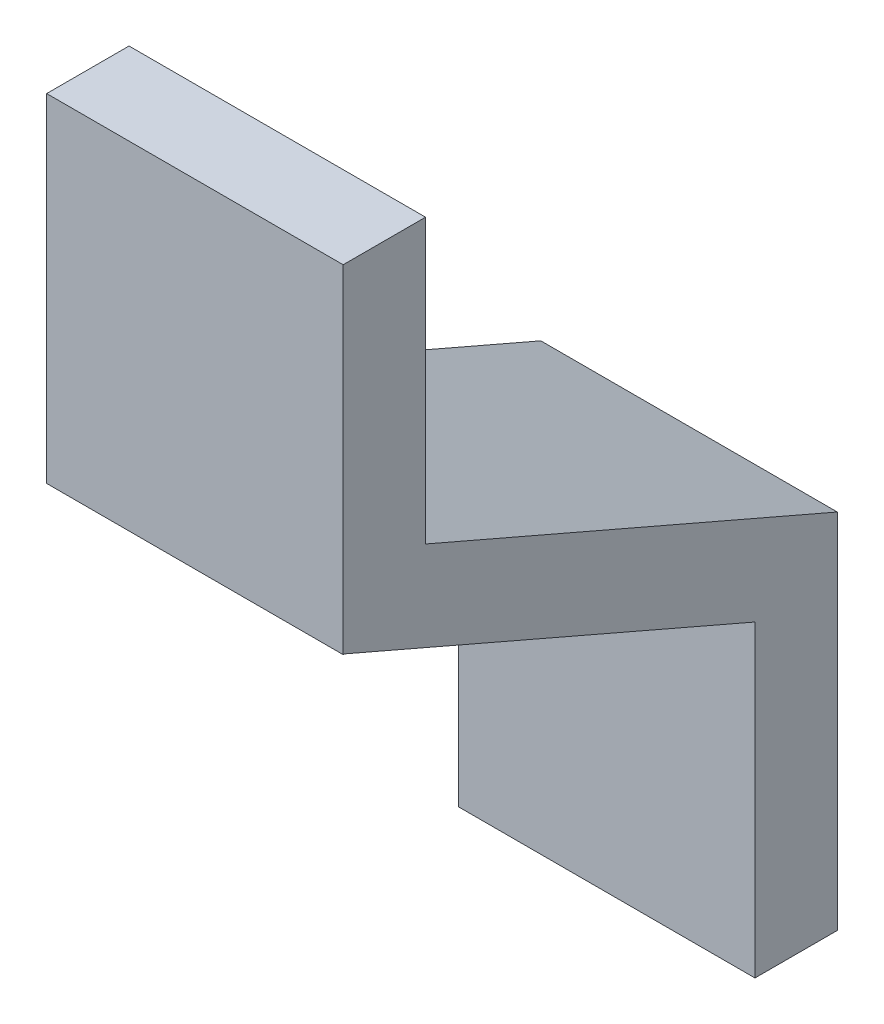
ISO-10303-21;
HEADER;
FILE_DESCRIPTION(('STEP AP214'),'2;1');
FILE_NAME('part.step','',(''),(''),'','','');
FILE_SCHEMA(('AUTOMOTIVE_DESIGN { 1 0 10303 214 1 1 1 1 }'));
ENDSEC;
DATA;
#1=APPLICATION_CONTEXT('core data for automotive mechanical design processes');
#2=APPLICATION_PROTOCOL_DEFINITION('international standard','automotive_design',2000,#1);
#3=PRODUCT_CONTEXT('',#1,'mechanical');
#4=PRODUCT('Part','Part','',(#3));
#5=PRODUCT_RELATED_PRODUCT_CATEGORY('part','',(#4));
#6=PRODUCT_DEFINITION_FORMATION('','',#4);
#7=PRODUCT_DEFINITION_CONTEXT('part definition',#1,'design');
#8=PRODUCT_DEFINITION('design','',#6,#7);
#9=PRODUCT_DEFINITION_SHAPE('','',#8);
#10=(LENGTH_UNIT() NAMED_UNIT(*) SI_UNIT(.MILLI.,.METRE.));
#11=(NAMED_UNIT(*) PLANE_ANGLE_UNIT() SI_UNIT($,.RADIAN.));
#12=(NAMED_UNIT(*) SI_UNIT($,.STERADIAN.) SOLID_ANGLE_UNIT());
#13=UNCERTAINTY_MEASURE_WITH_UNIT(LENGTH_MEASURE(1.E-05),#10,'distance_accuracy_value','');
#14=(GEOMETRIC_REPRESENTATION_CONTEXT(3) GLOBAL_UNCERTAINTY_ASSIGNED_CONTEXT((#13)) GLOBAL_UNIT_ASSIGNED_CONTEXT((#10,
#11,#12)) REPRESENTATION_CONTEXT('',''));
#15=CARTESIAN_POINT('',(0.,0.,0.));
#16=DIRECTION('',(0.,0.,1.));
#17=DIRECTION('',(1.,0.,0.));
#18=AXIS2_PLACEMENT_3D('',#15,#16,#17);
#19=CARTESIAN_POINT('',(8.22,0.999999996424,0.5));
#20=DIRECTION('',(0.,1.,0.));
#21=DIRECTION('',(0.,0.,1.));
#22=AXIS2_PLACEMENT_3D('',#19,#20,#21);
#23=PLANE('',#22);
#24=DIRECTION('',(1.,0.,0.));
#25=VECTOR('',#24,1.);
#26=CARTESIAN_POINT('',(8.22,0.999999996424,0.5));
#27=LINE('',#26,#25);
#28=CARTESIAN_POINT('',(8.580000014305,0.999999996424,0.5));
#29=VERTEX_POINT('',#28);
#30=CARTESIAN_POINT('',(8.22,0.999999996424,0.5));
#31=VERTEX_POINT('',#30);
#32=EDGE_CURVE('E140',#29,#31,#27,.F.);
#33=ORIENTED_EDGE('',*,*,#32,.T.);
#34=DIRECTION('',(0.,0.,-1.));
#35=VECTOR('',#34,1.);
#36=CARTESIAN_POINT('',(8.22,0.999999996424,0.));
#37=LINE('',#36,#35);
#38=CARTESIAN_POINT('',(8.22,0.999999996424,0.60000000149));
#39=VERTEX_POINT('',#38);
#40=EDGE_CURVE('E133',#31,#39,#37,.F.);
#41=ORIENTED_EDGE('',*,*,#40,.T.);
#42=DIRECTION('',(1.,0.,0.));
#43=VECTOR('',#42,1.);
#44=CARTESIAN_POINT('',(8.22,0.999999996424,0.60000000149));
#45=LINE('',#44,#43);
#46=CARTESIAN_POINT('',(8.580000014305,0.999999996424,0.60000000149));
#47=VERTEX_POINT('',#46);
#48=EDGE_CURVE('E129',#47,#39,#45,.F.);
#49=ORIENTED_EDGE('',*,*,#48,.F.);
#50=DIRECTION('',(0.,0.,-1.));
#51=VECTOR('',#50,1.);
#52=CARTESIAN_POINT('',(8.580000014305,0.999999996424,0.));
#53=LINE('',#52,#51);
#54=EDGE_CURVE('E106',#29,#47,#53,.F.);
#55=ORIENTED_EDGE('',*,*,#54,.F.);
#56=EDGE_LOOP('',(#33,#41,#49,#55));
#57=FACE_BOUND('',#56,.T.);
#58=ADVANCED_FACE('F17',(#57),#23,.T.);
#59=CARTESIAN_POINT('',(8.22,0.59,0.60000000149));
#60=DIRECTION('',(0.,0.,1.));
#61=DIRECTION('',(1.,0.,0.));
#62=AXIS2_PLACEMENT_3D('',#59,#60,#61);
#63=PLANE('',#62);
#64=DIRECTION('',(0.,1.,0.));
#65=VECTOR('',#64,1.);
#66=CARTESIAN_POINT('',(8.22,0.44,0.60000000149));
#67=LINE('',#66,#65);
#68=CARTESIAN_POINT('',(8.22,0.59,0.60000000149));
#69=VERTEX_POINT('',#68);
#70=EDGE_CURVE('E136',#39,#69,#67,.F.);
#71=ORIENTED_EDGE('',*,*,#70,.T.);
#72=DIRECTION('',(1.,0.,0.));
#73=VECTOR('',#72,1.);
#74=CARTESIAN_POINT('',(8.22,0.59,0.60000000149));
#75=LINE('',#74,#73);
#76=CARTESIAN_POINT('',(8.580000014305,0.59,0.60000000149));
#77=VERTEX_POINT('',#76);
#78=EDGE_CURVE('E92',#69,#77,#75,.T.);
#79=ORIENTED_EDGE('',*,*,#78,.T.);
#80=DIRECTION('',(0.,1.,0.));
#81=VECTOR('',#80,1.);
#82=CARTESIAN_POINT('',(8.580000014305,0.44,0.60000000149));
#83=LINE('',#82,#81);
#84=EDGE_CURVE('E73',#47,#77,#83,.F.);
#85=ORIENTED_EDGE('',*,*,#84,.F.);
#86=ORIENTED_EDGE('',*,*,#48,.T.);
#87=EDGE_LOOP('',(#71,#79,#85,#86));
#88=FACE_BOUND('',#87,.T.);
#89=ADVANCED_FACE('F285',(#88),#63,.T.);
#90=CARTESIAN_POINT('',(8.22,0.59,0.5));
#91=DIRECTION('',(0.,1.,0.));
#92=DIRECTION('',(0.,0.,1.));
#93=AXIS2_PLACEMENT_3D('',#90,#91,#92);
#94=PLANE('',#93);
#95=DIRECTION('',(1.,0.,0.));
#96=VECTOR('',#95,1.);
#97=CARTESIAN_POINT('',(8.22,0.590000000000416,0.59842599626982));
#98=LINE('',#97,#96);
#99=CARTESIAN_POINT('',(8.580000014305,0.590000000000104,0.598425996269911));
#100=VERTEX_POINT('',#99);
#101=CARTESIAN_POINT('',(8.22,0.590000000000104,0.59842599626991));
#102=VERTEX_POINT('',#101);
#103=EDGE_CURVE('E84',#100,#102,#98,.F.);
#104=ORIENTED_EDGE('',*,*,#103,.F.);
#105=DIRECTION('',(0.,0.,-1.));
#106=VECTOR('',#105,1.);
#107=CARTESIAN_POINT('',(8.580000014305,0.59,0.));
#108=LINE('',#107,#106);
#109=EDGE_CURVE('E20',#77,#100,#108,.T.);
#110=ORIENTED_EDGE('',*,*,#109,.F.);
#111=ORIENTED_EDGE('',*,*,#78,.F.);
#112=DIRECTION('',(0.,0.,1.));
#113=VECTOR('',#112,1.);
#114=CARTESIAN_POINT('',(8.22,0.59,0.5));
#115=LINE('',#114,#113);
#116=EDGE_CURVE('E87',#69,#102,#115,.F.);
#117=ORIENTED_EDGE('',*,*,#116,.T.);
#118=EDGE_LOOP('',(#104,#110,#111,#117));
#119=FACE_BOUND('',#118,.T.);
#120=ADVANCED_FACE('F85',(#119),#94,.F.);
#121=CARTESIAN_POINT('',(8.22,0.348224508223,0.03971472531736));
#122=DIRECTION('',(0.,-0.917754904098641,0.397147247255844));
#123=DIRECTION('',(0.,-0.397147247255844,-0.917754904098641));
#124=AXIS2_PLACEMENT_3D('',#121,#122,#123);
#125=PLANE('',#124);
#126=DIRECTION('',(0.,-0.397147247255413,-0.917754904098827));
#127=VECTOR('',#126,1.);
#128=CARTESIAN_POINT('',(8.580000014305,0.59,0.59842599627));
#129=LINE('',#128,#127);
#130=CARTESIAN_POINT('',(8.580000014305,0.37431222660502,0.10000000149));
#131=VERTEX_POINT('',#130);
#132=EDGE_CURVE('E80',#100,#131,#129,.T.);
#133=ORIENTED_EDGE('',*,*,#132,.F.);
#134=ORIENTED_EDGE('',*,*,#103,.T.);
#135=DIRECTION('',(0.,-0.397147247255413,-0.917754904098827));
#136=VECTOR('',#135,1.);
#137=CARTESIAN_POINT('',(8.22,0.59,0.59842599627));
#138=LINE('',#137,#136);
#139=CARTESIAN_POINT('',(8.22,0.374312226605,0.10000000149));
#140=VERTEX_POINT('',#139);
#141=EDGE_CURVE('E122',#102,#140,#138,.T.);
#142=ORIENTED_EDGE('',*,*,#141,.T.);
#143=DIRECTION('',(1.,0.,0.));
#144=VECTOR('',#143,1.);
#145=CARTESIAN_POINT('',(8.22,0.374312226605,0.10000000149));
#146=LINE('',#145,#144);
#147=EDGE_CURVE('E91',#131,#140,#146,.F.);
#148=ORIENTED_EDGE('',*,*,#147,.F.);
#149=EDGE_LOOP('',(#133,#134,#142,#148));
#150=FACE_BOUND('',#149,.T.);
#151=ADVANCED_FACE('F94',(#150),#125,.T.);
#152=CARTESIAN_POINT('',(8.22,0.,0.10000000149));
#153=DIRECTION('',(0.,0.,1.));
#154=DIRECTION('',(1.,0.,0.));
#155=AXIS2_PLACEMENT_3D('',#152,#153,#154);
#156=PLANE('',#155);
#157=ORIENTED_EDGE('',*,*,#147,.T.);
#158=DIRECTION('',(0.,1.,0.));
#159=VECTOR('',#158,1.);
#160=CARTESIAN_POINT('',(8.22,0.44,0.10000000149));
#161=LINE('',#160,#159);
#162=CARTESIAN_POINT('',(8.22,0.,0.10000000149));
#163=VERTEX_POINT('',#162);
#164=EDGE_CURVE('E118',#140,#163,#161,.F.);
#165=ORIENTED_EDGE('',*,*,#164,.T.);
#166=DIRECTION('',(1.,0.,0.));
#167=VECTOR('',#166,1.);
#168=CARTESIAN_POINT('',(8.22,0.,0.10000000149));
#169=LINE('',#168,#167);
#170=CARTESIAN_POINT('',(8.580000014305,0.,0.10000000149));
#171=VERTEX_POINT('',#170);
#172=EDGE_CURVE('E115',#163,#171,#169,.T.);
#173=ORIENTED_EDGE('',*,*,#172,.T.);
#174=DIRECTION('',(0.,1.,0.));
#175=VECTOR('',#174,1.);
#176=CARTESIAN_POINT('',(8.580000014305,0.44,0.10000000149));
#177=LINE('',#176,#175);
#178=EDGE_CURVE('E96',#131,#171,#177,.F.);
#179=ORIENTED_EDGE('',*,*,#178,.F.);
#180=EDGE_LOOP('',(#157,#165,#173,#179));
#181=FACE_BOUND('',#180,.T.);
#182=ADVANCED_FACE('F202',(#181),#156,.T.);
#183=CARTESIAN_POINT('',(8.22,0.,0.));
#184=DIRECTION('',(0.,1.,0.));
#185=DIRECTION('',(0.,0.,1.));
#186=AXIS2_PLACEMENT_3D('',#183,#184,#185);
#187=PLANE('',#186);
#188=DIRECTION('',(0.,0.,-1.));
#189=VECTOR('',#188,1.);
#190=CARTESIAN_POINT('',(8.22,0.,0.));
#191=LINE('',#190,#189);
#192=CARTESIAN_POINT('',(8.22,0.,0.));
#193=VERTEX_POINT('',#192);
#194=EDGE_CURVE('E121',#163,#193,#191,.T.);
#195=ORIENTED_EDGE('',*,*,#194,.T.);
#196=DIRECTION('',(1.,0.,0.));
#197=VECTOR('',#196,1.);
#198=CARTESIAN_POINT('',(8.22,0.,0.));
#199=LINE('',#198,#197);
#200=CARTESIAN_POINT('',(8.580000014305,0.,0.));
#201=VERTEX_POINT('',#200);
#202=EDGE_CURVE('E112',#193,#201,#199,.T.);
#203=ORIENTED_EDGE('',*,*,#202,.T.);
#204=DIRECTION('',(0.,0.,-1.));
#205=VECTOR('',#204,1.);
#206=CARTESIAN_POINT('',(8.580000014305,0.,0.));
#207=LINE('',#206,#205);
#208=EDGE_CURVE('E98',#171,#201,#207,.T.);
#209=ORIENTED_EDGE('',*,*,#208,.F.);
#210=ORIENTED_EDGE('',*,*,#172,.F.);
#211=EDGE_LOOP('',(#195,#203,#209,#210));
#212=FACE_BOUND('',#211,.T.);
#213=ADVANCED_FACE('F206',(#212),#187,.F.);
#214=CARTESIAN_POINT('',(8.22,0.,0.));
#215=DIRECTION('',(0.,0.,1.));
#216=DIRECTION('',(1.,0.,0.));
#217=AXIS2_PLACEMENT_3D('',#214,#215,#216);
#218=PLANE('',#217);
#219=ORIENTED_EDGE('',*,*,#202,.F.);
#220=DIRECTION('',(0.,1.,0.));
#221=VECTOR('',#220,1.);
#222=CARTESIAN_POINT('',(8.22,0.44,0.));
#223=LINE('',#222,#221);
#224=CARTESIAN_POINT('',(8.22,0.439999998997445,-1.94673175919965E-10));
#225=VERTEX_POINT('',#224);
#226=EDGE_CURVE('E178',#193,#225,#223,.T.);
#227=ORIENTED_EDGE('',*,*,#226,.T.);
#228=DIRECTION('',(1.,0.,0.));
#229=VECTOR('',#228,1.);
#230=CARTESIAN_POINT('',(8.22,0.43999999966303,-7.78692710220355E-10));
#231=LINE('',#230,#229);
#232=CARTESIAN_POINT('',(8.580000014305,0.439999998997445,-1.94673175919965E-10));
#233=VERTEX_POINT('',#232);
#234=EDGE_CURVE('E163',#225,#233,#231,.T.);
#235=ORIENTED_EDGE('',*,*,#234,.T.);
#236=DIRECTION('',(0.,1.,0.));
#237=VECTOR('',#236,1.);
#238=CARTESIAN_POINT('',(8.580000014305,0.44,0.));
#239=LINE('',#238,#237);
#240=EDGE_CURVE('E109',#201,#233,#239,.T.);
#241=ORIENTED_EDGE('',*,*,#240,.F.);
#242=EDGE_LOOP('',(#219,#227,#235,#241));
#243=FACE_BOUND('',#242,.T.);
#244=ADVANCED_FACE('F186',(#243),#218,.F.);
#245=CARTESIAN_POINT('',(8.580000014305,0.44,0.));
#246=DIRECTION('',(1.,0.,0.));
#247=DIRECTION('',(0.,0.,-1.));
#248=AXIS2_PLACEMENT_3D('',#245,#246,#247);
#249=PLANE('',#248);
#250=ORIENTED_EDGE('',*,*,#178,.T.);
#251=ORIENTED_EDGE('',*,*,#208,.T.);
#252=ORIENTED_EDGE('',*,*,#240,.T.);
#253=DIRECTION('',(0.,-0.397147247255844,-0.917754904098641));
#254=VECTOR('',#253,1.);
#255=CARTESIAN_POINT('',(8.580000014305,0.44,0.));
#256=LINE('',#255,#254);
#257=CARTESIAN_POINT('',(8.580000014305,0.656368904967003,0.499999999999999));
#258=VERTEX_POINT('',#257);
#259=EDGE_CURVE('E151',#233,#258,#256,.F.);
#260=ORIENTED_EDGE('',*,*,#259,.T.);
#261=DIRECTION('',(0.,1.,0.));
#262=VECTOR('',#261,1.);
#263=CARTESIAN_POINT('',(8.580000014305,0.59,0.5));
#264=LINE('',#263,#262);
#265=EDGE_CURVE('E144',#258,#29,#264,.T.);
#266=ORIENTED_EDGE('',*,*,#265,.T.);
#267=ORIENTED_EDGE('',*,*,#54,.T.);
#268=ORIENTED_EDGE('',*,*,#84,.T.);
#269=ORIENTED_EDGE('',*,*,#109,.T.);
#270=ORIENTED_EDGE('',*,*,#132,.T.);
#271=EDGE_LOOP('',(#250,#251,#252,#260,#266,#267,#268,#269,#270));
#272=FACE_BOUND('',#271,.T.);
#273=ADVANCED_FACE('F78',(#272),#249,.T.);
#274=CARTESIAN_POINT('',(8.22,0.59,0.5));
#275=DIRECTION('',(0.,0.,1.));
#276=DIRECTION('',(1.,0.,0.));
#277=AXIS2_PLACEMENT_3D('',#274,#275,#276);
#278=PLANE('',#277);
#279=ORIENTED_EDGE('',*,*,#265,.F.);
#280=DIRECTION('',(1.,0.,0.));
#281=VECTOR('',#280,1.);
#282=CARTESIAN_POINT('',(8.22,0.656368904967005,0.499999999999998));
#283=LINE('',#282,#281);
#284=CARTESIAN_POINT('',(8.22,0.656368904967001,0.5));
#285=VERTEX_POINT('',#284);
#286=EDGE_CURVE('E26',#258,#285,#283,.F.);
#287=ORIENTED_EDGE('',*,*,#286,.T.);
#288=DIRECTION('',(0.,1.,0.));
#289=VECTOR('',#288,1.);
#290=CARTESIAN_POINT('',(8.22,0.44,0.5));
#291=LINE('',#290,#289);
#292=EDGE_CURVE('E34',#285,#31,#291,.T.);
#293=ORIENTED_EDGE('',*,*,#292,.T.);
#294=ORIENTED_EDGE('',*,*,#32,.F.);
#295=EDGE_LOOP('',(#279,#287,#293,#294));
#296=FACE_BOUND('',#295,.T.);
#297=ADVANCED_FACE('F212',(#296),#278,.F.);
#298=CARTESIAN_POINT('',(8.22,0.44,0.));
#299=DIRECTION('',(1.,0.,0.));
#300=DIRECTION('',(0.,0.,-1.));
#301=AXIS2_PLACEMENT_3D('',#298,#299,#300);
#302=PLANE('',#301);
#303=ORIENTED_EDGE('',*,*,#226,.F.);
#304=ORIENTED_EDGE('',*,*,#194,.F.);
#305=ORIENTED_EDGE('',*,*,#164,.F.);
#306=ORIENTED_EDGE('',*,*,#141,.F.);
#307=ORIENTED_EDGE('',*,*,#116,.F.);
#308=ORIENTED_EDGE('',*,*,#70,.F.);
#309=ORIENTED_EDGE('',*,*,#40,.F.);
#310=ORIENTED_EDGE('',*,*,#292,.F.);
#311=DIRECTION('',(0.,-0.397147247255844,-0.917754904098641));
#312=VECTOR('',#311,1.);
#313=CARTESIAN_POINT('',(8.22,0.44,0.));
#314=LINE('',#313,#312);
#315=EDGE_CURVE('E11',#285,#225,#314,.T.);
#316=ORIENTED_EDGE('',*,*,#315,.T.);
#317=EDGE_LOOP('',(#303,#304,#305,#306,#307,#308,#309,#310,#316));
#318=FACE_BOUND('',#317,.T.);
#319=ADVANCED_FACE('F207',(#318),#302,.F.);
#320=CARTESIAN_POINT('',(8.22,0.44,0.));
#321=DIRECTION('',(0.,-0.917754904098641,0.397147247255844));
#322=DIRECTION('',(0.,-0.397147247255844,-0.917754904098641));
#323=AXIS2_PLACEMENT_3D('',#320,#321,#322);
#324=PLANE('',#323);
#325=ORIENTED_EDGE('',*,*,#286,.F.);
#326=ORIENTED_EDGE('',*,*,#259,.F.);
#327=ORIENTED_EDGE('',*,*,#234,.F.);
#328=ORIENTED_EDGE('',*,*,#315,.F.);
#329=EDGE_LOOP('',(#325,#326,#327,#328));
#330=FACE_BOUND('',#329,.T.);
#331=ADVANCED_FACE('F193',(#330),#324,.F.);
#332=CLOSED_SHELL('',(#58,#89,#120,#151,#182,#213,#244,#273,#297,#319,#331));
#333=MANIFOLD_SOLID_BREP('B1',#332);
#334=ADVANCED_BREP_SHAPE_REPRESENTATION('',(#18,#333),#14);
#335=SHAPE_DEFINITION_REPRESENTATION(#9,#334);
ENDSEC;
END-ISO-10303-21;
